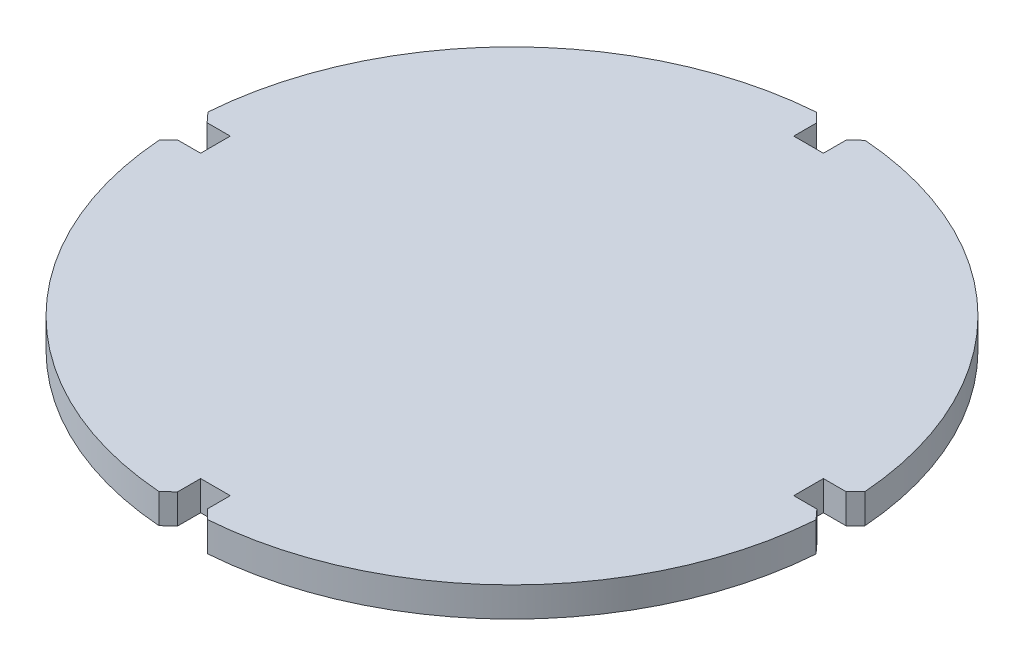
ISO-10303-21;
HEADER;
FILE_DESCRIPTION(('STEP AP214'),'2;1');
FILE_NAME('part.step','',(''),(''),'','','');
FILE_SCHEMA(('AUTOMOTIVE_DESIGN { 1 0 10303 214 1 1 1 1 }'));
ENDSEC;
DATA;
#1=APPLICATION_CONTEXT('core data for automotive mechanical design processes');
#2=APPLICATION_PROTOCOL_DEFINITION('international standard','automotive_design',2000,#1);
#3=PRODUCT_CONTEXT('',#1,'mechanical');
#4=PRODUCT('Part','Part','',(#3));
#5=PRODUCT_RELATED_PRODUCT_CATEGORY('part','',(#4));
#6=PRODUCT_DEFINITION_FORMATION('','',#4);
#7=PRODUCT_DEFINITION_CONTEXT('part definition',#1,'design');
#8=PRODUCT_DEFINITION('design','',#6,#7);
#9=PRODUCT_DEFINITION_SHAPE('','',#8);
#10=(LENGTH_UNIT() NAMED_UNIT(*) SI_UNIT(.MILLI.,.METRE.));
#11=(NAMED_UNIT(*) PLANE_ANGLE_UNIT() SI_UNIT($,.RADIAN.));
#12=(NAMED_UNIT(*) SI_UNIT($,.STERADIAN.) SOLID_ANGLE_UNIT());
#13=UNCERTAINTY_MEASURE_WITH_UNIT(LENGTH_MEASURE(1.E-05),#10,'distance_accuracy_value','');
#14=(GEOMETRIC_REPRESENTATION_CONTEXT(3) GLOBAL_UNCERTAINTY_ASSIGNED_CONTEXT((#13)) GLOBAL_UNIT_ASSIGNED_CONTEXT((#10,
#11,#12)) REPRESENTATION_CONTEXT('',''));
#15=CARTESIAN_POINT('',(0.,0.,0.));
#16=DIRECTION('',(0.,0.,1.));
#17=DIRECTION('',(1.,0.,0.));
#18=AXIS2_PLACEMENT_3D('',#15,#16,#17);
#19=CARTESIAN_POINT('',(-2.25000000000001,4.5,-49.9493493451116));
#20=DIRECTION('',(1.,0.,0.));
#21=DIRECTION('',(0.,0.,-1.));
#22=AXIS2_PLACEMENT_3D('',#19,#20,#21);
#23=PLANE('',#22);
#24=DIRECTION('',(0.,0.,1.));
#25=VECTOR('',#24,1.);
#26=CARTESIAN_POINT('',(-2.25000000000001,0.,-49.9493493451116));
#27=LINE('',#26,#25);
#28=CARTESIAN_POINT('',(-2.25000000000001,0.,-48.4493493451116));
#29=VERTEX_POINT('',#28);
#30=CARTESIAN_POINT('',(-2.25000000000001,0.,-45.));
#31=VERTEX_POINT('',#30);
#32=EDGE_CURVE('E257',#29,#31,#27,.T.);
#33=ORIENTED_EDGE('',*,*,#32,.F.);
#34=DIRECTION('',(0.,1.,0.));
#35=VECTOR('',#34,1.);
#36=CARTESIAN_POINT('',(-2.25000000000001,4.5,-48.4493493451116));
#37=LINE('',#36,#35);
#38=CARTESIAN_POINT('',(-2.25000000000001,4.5,-48.4493493451116));
#39=VERTEX_POINT('',#38);
#40=EDGE_CURVE('E203',#29,#39,#37,.T.);
#41=ORIENTED_EDGE('',*,*,#40,.T.);
#42=DIRECTION('',(0.,0.,1.));
#43=VECTOR('',#42,1.);
#44=CARTESIAN_POINT('',(-2.25000000000001,4.5,-49.9493493451116));
#45=LINE('',#44,#43);
#46=CARTESIAN_POINT('',(-2.25000000000001,4.5,-45.));
#47=VERTEX_POINT('',#46);
#48=EDGE_CURVE('E197',#39,#47,#45,.T.);
#49=ORIENTED_EDGE('',*,*,#48,.T.);
#50=DIRECTION('',(0.,-1.,0.));
#51=VECTOR('',#50,1.);
#52=CARTESIAN_POINT('',(-2.25000000000001,4.5,-45.));
#53=LINE('',#52,#51);
#54=EDGE_CURVE('E200',#47,#31,#53,.T.);
#55=ORIENTED_EDGE('',*,*,#54,.T.);
#56=EDGE_LOOP('',(#33,#41,#49,#55));
#57=FACE_BOUND('',#56,.T.);
#58=ADVANCED_FACE('F33',(#57),#23,.T.);
#59=CARTESIAN_POINT('',(0.,4.5,0.));
#60=DIRECTION('',(0.,-1.,0.));
#61=DIRECTION('',(0.,0.,-1.));
#62=AXIS2_PLACEMENT_3D('',#59,#60,#61);
#63=CYLINDRICAL_SURFACE('',#62,50.);
#64=CARTESIAN_POINT('',(0.,0.,0.));
#65=DIRECTION('',(0.,1.,0.));
#66=DIRECTION('',(0.,0.,1.));
#67=AXIS2_PLACEMENT_3D('',#64,#65,#66);
#68=CIRCLE('',#67,50.);
#69=CARTESIAN_POINT('',(-3.6660689192461,0.,-49.8654182643577));
#70=VERTEX_POINT('',#69);
#71=CARTESIAN_POINT('',(-49.8610009765848,0.,-3.72566525777803));
#72=VERTEX_POINT('',#71);
#73=EDGE_CURVE('E207',#70,#72,#68,.T.);
#74=ORIENTED_EDGE('',*,*,#73,.T.);
#75=DIRECTION('',(0.,-1.,0.));
#76=VECTOR('',#75,1.);
#77=CARTESIAN_POINT('',(-49.8610009765848,4.5,-3.72566525777803));
#78=LINE('',#77,#76);
#79=CARTESIAN_POINT('',(-49.8610009765848,4.5,-3.72566525777803));
#80=VERTEX_POINT('',#79);
#81=EDGE_CURVE('E357',#72,#80,#78,.F.);
#82=ORIENTED_EDGE('',*,*,#81,.T.);
#83=CARTESIAN_POINT('',(0.,4.5,0.));
#84=DIRECTION('',(0.,1.,0.));
#85=DIRECTION('',(0.,0.,1.));
#86=AXIS2_PLACEMENT_3D('',#83,#84,#85);
#87=CIRCLE('',#86,50.);
#88=CARTESIAN_POINT('',(-3.6660689192461,4.5,-49.8654182643577));
#89=VERTEX_POINT('',#88);
#90=EDGE_CURVE('E215',#89,#80,#87,.T.);
#91=ORIENTED_EDGE('',*,*,#90,.F.);
#92=DIRECTION('',(0.,-1.,0.));
#93=VECTOR('',#92,1.);
#94=CARTESIAN_POINT('',(-3.6660689192461,4.5,-49.8654182643577));
#95=LINE('',#94,#93);
#96=EDGE_CURVE('E354',#89,#70,#95,.T.);
#97=ORIENTED_EDGE('',*,*,#96,.T.);
#98=EDGE_LOOP('',(#74,#82,#91,#97));
#99=FACE_BOUND('',#98,.T.);
#100=ADVANCED_FACE('F433',(#99),#63,.T.);
#101=CARTESIAN_POINT('',(-45.,4.5,-2.24999999999999));
#102=DIRECTION('',(0.,0.,1.));
#103=DIRECTION('',(1.,0.,0.));
#104=AXIS2_PLACEMENT_3D('',#101,#102,#103);
#105=PLANE('',#104);
#106=DIRECTION('',(-1.,0.,0.));
#107=VECTOR('',#106,1.);
#108=CARTESIAN_POINT('',(-45.,4.5,-2.24999999999999));
#109=LINE('',#108,#107);
#110=CARTESIAN_POINT('',(-45.,4.5,-2.24999999999999));
#111=VERTEX_POINT('',#110);
#112=CARTESIAN_POINT('',(-48.5125498267087,4.5,-2.25));
#113=VERTEX_POINT('',#112);
#114=EDGE_CURVE('E252',#111,#113,#109,.T.);
#115=ORIENTED_EDGE('',*,*,#114,.T.);
#116=DIRECTION('',(0.,-1.,0.));
#117=VECTOR('',#116,1.);
#118=CARTESIAN_POINT('',(-48.5125498267087,0.,-2.25));
#119=LINE('',#118,#117);
#120=CARTESIAN_POINT('',(-48.5125498267087,0.,-2.25));
#121=VERTEX_POINT('',#120);
#122=EDGE_CURVE('E351',#113,#121,#119,.T.);
#123=ORIENTED_EDGE('',*,*,#122,.T.);
#124=DIRECTION('',(-1.,0.,0.));
#125=VECTOR('',#124,1.);
#126=CARTESIAN_POINT('',(-45.,0.,-2.24999999999999));
#127=LINE('',#126,#125);
#128=CARTESIAN_POINT('',(-45.,0.,-2.24999999999999));
#129=VERTEX_POINT('',#128);
#130=EDGE_CURVE('E292',#129,#121,#127,.T.);
#131=ORIENTED_EDGE('',*,*,#130,.F.);
#132=DIRECTION('',(0.,-1.,0.));
#133=VECTOR('',#132,1.);
#134=CARTESIAN_POINT('',(-45.,4.5,-2.24999999999999));
#135=LINE('',#134,#133);
#136=EDGE_CURVE('E297',#111,#129,#135,.T.);
#137=ORIENTED_EDGE('',*,*,#136,.F.);
#138=EDGE_LOOP('',(#115,#123,#131,#137));
#139=FACE_BOUND('',#138,.T.);
#140=ADVANCED_FACE('F441',(#139),#105,.T.);
#141=CARTESIAN_POINT('',(-45.,4.5,2.25));
#142=DIRECTION('',(-1.,0.,0.));
#143=DIRECTION('',(0.,0.,1.));
#144=AXIS2_PLACEMENT_3D('',#141,#142,#143);
#145=PLANE('',#144);
#146=DIRECTION('',(0.,0.,-1.));
#147=VECTOR('',#146,1.);
#148=CARTESIAN_POINT('',(-45.,0.,2.25));
#149=LINE('',#148,#147);
#150=CARTESIAN_POINT('',(-45.,0.,2.25));
#151=VERTEX_POINT('',#150);
#152=EDGE_CURVE('E289',#151,#129,#149,.T.);
#153=ORIENTED_EDGE('',*,*,#152,.F.);
#154=DIRECTION('',(0.,-1.,0.));
#155=VECTOR('',#154,1.);
#156=CARTESIAN_POINT('',(-45.,4.5,2.25));
#157=LINE('',#156,#155);
#158=CARTESIAN_POINT('',(-45.,4.5,2.25));
#159=VERTEX_POINT('',#158);
#160=EDGE_CURVE('E300',#159,#151,#157,.T.);
#161=ORIENTED_EDGE('',*,*,#160,.F.);
#162=DIRECTION('',(0.,0.,-1.));
#163=VECTOR('',#162,1.);
#164=CARTESIAN_POINT('',(-45.,4.5,2.25));
#165=LINE('',#164,#163);
#166=EDGE_CURVE('E249',#159,#111,#165,.T.);
#167=ORIENTED_EDGE('',*,*,#166,.T.);
#168=ORIENTED_EDGE('',*,*,#136,.T.);
#169=EDGE_LOOP('',(#153,#161,#167,#168));
#170=FACE_BOUND('',#169,.T.);
#171=ADVANCED_FACE('F445',(#170),#145,.T.);
#172=CARTESIAN_POINT('',(-49.9493493451116,4.5,2.25000000000001));
#173=DIRECTION('',(0.,0.,-1.));
#174=DIRECTION('',(-1.,0.,0.));
#175=AXIS2_PLACEMENT_3D('',#172,#173,#174);
#176=PLANE('',#175);
#177=DIRECTION('',(1.,0.,0.));
#178=VECTOR('',#177,1.);
#179=CARTESIAN_POINT('',(-49.9493493451116,0.,2.25000000000001));
#180=LINE('',#179,#178);
#181=CARTESIAN_POINT('',(-48.4493493451116,0.,2.25000000000001));
#182=VERTEX_POINT('',#181);
#183=EDGE_CURVE('E287',#182,#151,#180,.T.);
#184=ORIENTED_EDGE('',*,*,#183,.F.);
#185=DIRECTION('',(0.,1.,0.));
#186=VECTOR('',#185,1.);
#187=CARTESIAN_POINT('',(-48.4493493451116,4.5,2.25000000000001));
#188=LINE('',#187,#186);
#189=CARTESIAN_POINT('',(-48.4493493451116,4.5,2.25000000000001));
#190=VERTEX_POINT('',#189);
#191=EDGE_CURVE('E334',#182,#190,#188,.T.);
#192=ORIENTED_EDGE('',*,*,#191,.T.);
#193=DIRECTION('',(1.,0.,0.));
#194=VECTOR('',#193,1.);
#195=CARTESIAN_POINT('',(-49.9493493451116,4.5,2.25000000000001));
#196=LINE('',#195,#194);
#197=EDGE_CURVE('E247',#190,#159,#196,.T.);
#198=ORIENTED_EDGE('',*,*,#197,.T.);
#199=ORIENTED_EDGE('',*,*,#160,.T.);
#200=EDGE_LOOP('',(#184,#192,#198,#199));
#201=FACE_BOUND('',#200,.T.);
#202=ADVANCED_FACE('F622',(#201),#176,.T.);
#203=CARTESIAN_POINT('',(0.,4.5,0.));
#204=DIRECTION('',(0.,-1.,0.));
#205=DIRECTION('',(0.,0.,-1.));
#206=AXIS2_PLACEMENT_3D('',#203,#204,#205);
#207=CYLINDRICAL_SURFACE('',#206,50.);
#208=CARTESIAN_POINT('',(0.,4.5,0.));
#209=DIRECTION('',(0.,1.,0.));
#210=DIRECTION('',(0.,0.,1.));
#211=AXIS2_PLACEMENT_3D('',#208,#209,#210);
#212=CIRCLE('',#211,50.);
#213=CARTESIAN_POINT('',(-49.8654182643577,4.5,3.66606891924611));
#214=VERTEX_POINT('',#213);
#215=CARTESIAN_POINT('',(-3.72566525777803,4.5,49.8610009765848));
#216=VERTEX_POINT('',#215);
#217=EDGE_CURVE('E244',#214,#216,#212,.T.);
#218=ORIENTED_EDGE('',*,*,#217,.F.);
#219=DIRECTION('',(0.,-1.,0.));
#220=VECTOR('',#219,1.);
#221=CARTESIAN_POINT('',(-49.8654182643577,4.5,3.66606891924611));
#222=LINE('',#221,#220);
#223=CARTESIAN_POINT('',(-49.8654182643577,0.,3.66606891924611));
#224=VERTEX_POINT('',#223);
#225=EDGE_CURVE('E315',#214,#224,#222,.T.);
#226=ORIENTED_EDGE('',*,*,#225,.T.);
#227=CARTESIAN_POINT('',(0.,0.,0.));
#228=DIRECTION('',(0.,1.,0.));
#229=DIRECTION('',(0.,0.,1.));
#230=AXIS2_PLACEMENT_3D('',#227,#228,#229);
#231=CIRCLE('',#230,50.);
#232=CARTESIAN_POINT('',(-3.72566525777803,0.,49.8610009765848));
#233=VERTEX_POINT('',#232);
#234=EDGE_CURVE('E284',#224,#233,#231,.T.);
#235=ORIENTED_EDGE('',*,*,#234,.T.);
#236=DIRECTION('',(0.,-1.,0.));
#237=VECTOR('',#236,1.);
#238=CARTESIAN_POINT('',(-3.72566525777803,4.5,49.8610009765848));
#239=LINE('',#238,#237);
#240=EDGE_CURVE('E299',#233,#216,#239,.F.);
#241=ORIENTED_EDGE('',*,*,#240,.T.);
#242=EDGE_LOOP('',(#218,#226,#235,#241));
#243=FACE_BOUND('',#242,.T.);
#244=ADVANCED_FACE('F455',(#243),#207,.T.);
#245=CARTESIAN_POINT('',(-2.25,4.5,45.));
#246=DIRECTION('',(1.,0.,0.));
#247=DIRECTION('',(0.,0.,-1.));
#248=AXIS2_PLACEMENT_3D('',#245,#246,#247);
#249=PLANE('',#248);
#250=DIRECTION('',(0.,0.,1.));
#251=VECTOR('',#250,1.);
#252=CARTESIAN_POINT('',(-2.25,4.5,45.));
#253=LINE('',#252,#251);
#254=CARTESIAN_POINT('',(-2.25,4.5,45.));
#255=VERTEX_POINT('',#254);
#256=CARTESIAN_POINT('',(-2.25,4.5,48.5125498267087));
#257=VERTEX_POINT('',#256);
#258=EDGE_CURVE('E241',#255,#257,#253,.T.);
#259=ORIENTED_EDGE('',*,*,#258,.T.);
#260=DIRECTION('',(0.,-1.,0.));
#261=VECTOR('',#260,1.);
#262=CARTESIAN_POINT('',(-2.25,0.,48.5125498267087));
#263=LINE('',#262,#261);
#264=CARTESIAN_POINT('',(-2.25,0.,48.5125498267087));
#265=VERTEX_POINT('',#264);
#266=EDGE_CURVE('E11',#257,#265,#263,.T.);
#267=ORIENTED_EDGE('',*,*,#266,.T.);
#268=DIRECTION('',(0.,0.,1.));
#269=VECTOR('',#268,1.);
#270=CARTESIAN_POINT('',(-2.25,0.,45.));
#271=LINE('',#270,#269);
#272=CARTESIAN_POINT('',(-2.25,0.,45.));
#273=VERTEX_POINT('',#272);
#274=EDGE_CURVE('E281',#273,#265,#271,.T.);
#275=ORIENTED_EDGE('',*,*,#274,.F.);
#276=DIRECTION('',(0.,-1.,0.));
#277=VECTOR('',#276,1.);
#278=CARTESIAN_POINT('',(-2.25,4.5,45.));
#279=LINE('',#278,#277);
#280=EDGE_CURVE('E303',#255,#273,#279,.T.);
#281=ORIENTED_EDGE('',*,*,#280,.F.);
#282=EDGE_LOOP('',(#259,#267,#275,#281));
#283=FACE_BOUND('',#282,.T.);
#284=ADVANCED_FACE('F463',(#283),#249,.T.);
#285=CARTESIAN_POINT('',(2.25,4.5,45.));
#286=DIRECTION('',(0.,0.,1.));
#287=DIRECTION('',(1.,0.,0.));
#288=AXIS2_PLACEMENT_3D('',#285,#286,#287);
#289=PLANE('',#288);
#290=DIRECTION('',(-1.,0.,0.));
#291=VECTOR('',#290,1.);
#292=CARTESIAN_POINT('',(2.25,0.,45.));
#293=LINE('',#292,#291);
#294=CARTESIAN_POINT('',(2.25,0.,45.));
#295=VERTEX_POINT('',#294);
#296=EDGE_CURVE('E278',#295,#273,#293,.T.);
#297=ORIENTED_EDGE('',*,*,#296,.F.);
#298=DIRECTION('',(0.,-1.,0.));
#299=VECTOR('',#298,1.);
#300=CARTESIAN_POINT('',(2.25,4.5,45.));
#301=LINE('',#300,#299);
#302=CARTESIAN_POINT('',(2.25,4.5,45.));
#303=VERTEX_POINT('',#302);
#304=EDGE_CURVE('E305',#303,#295,#301,.T.);
#305=ORIENTED_EDGE('',*,*,#304,.F.);
#306=DIRECTION('',(-1.,0.,0.));
#307=VECTOR('',#306,1.);
#308=CARTESIAN_POINT('',(2.25,4.5,45.));
#309=LINE('',#308,#307);
#310=EDGE_CURVE('E238',#303,#255,#309,.T.);
#311=ORIENTED_EDGE('',*,*,#310,.T.);
#312=ORIENTED_EDGE('',*,*,#280,.T.);
#313=EDGE_LOOP('',(#297,#305,#311,#312));
#314=FACE_BOUND('',#313,.T.);
#315=ADVANCED_FACE('F466',(#314),#289,.T.);
#316=CARTESIAN_POINT('',(2.25,4.5,49.9493493451116));
#317=DIRECTION('',(-1.,0.,0.));
#318=DIRECTION('',(0.,0.,1.));
#319=AXIS2_PLACEMENT_3D('',#316,#317,#318);
#320=PLANE('',#319);
#321=DIRECTION('',(0.,0.,-1.));
#322=VECTOR('',#321,1.);
#323=CARTESIAN_POINT('',(2.25,0.,49.9493493451116));
#324=LINE('',#323,#322);
#325=CARTESIAN_POINT('',(2.25,0.,48.4493493451116));
#326=VERTEX_POINT('',#325);
#327=EDGE_CURVE('E276',#326,#295,#324,.T.);
#328=ORIENTED_EDGE('',*,*,#327,.F.);
#329=DIRECTION('',(0.,1.,0.));
#330=VECTOR('',#329,1.);
#331=CARTESIAN_POINT('',(2.25,4.5,48.4493493451116));
#332=LINE('',#331,#330);
#333=CARTESIAN_POINT('',(2.25,4.5,48.4493493451116));
#334=VERTEX_POINT('',#333);
#335=EDGE_CURVE('E41',#326,#334,#332,.T.);
#336=ORIENTED_EDGE('',*,*,#335,.T.);
#337=DIRECTION('',(0.,0.,-1.));
#338=VECTOR('',#337,1.);
#339=CARTESIAN_POINT('',(2.25,4.5,49.9493493451116));
#340=LINE('',#339,#338);
#341=EDGE_CURVE('E236',#334,#303,#340,.T.);
#342=ORIENTED_EDGE('',*,*,#341,.T.);
#343=ORIENTED_EDGE('',*,*,#304,.T.);
#344=EDGE_LOOP('',(#328,#336,#342,#343));
#345=FACE_BOUND('',#344,.T.);
#346=ADVANCED_FACE('F380',(#345),#320,.T.);
#347=CARTESIAN_POINT('',(0.,4.5,0.));
#348=DIRECTION('',(0.,-1.,0.));
#349=DIRECTION('',(0.,0.,-1.));
#350=AXIS2_PLACEMENT_3D('',#347,#348,#349);
#351=CYLINDRICAL_SURFACE('',#350,50.);
#352=CARTESIAN_POINT('',(0.,0.,0.));
#353=DIRECTION('',(0.,1.,0.));
#354=DIRECTION('',(0.,0.,1.));
#355=AXIS2_PLACEMENT_3D('',#352,#353,#354);
#356=CIRCLE('',#355,50.);
#357=CARTESIAN_POINT('',(3.66606891924611,0.,49.8654182643577));
#358=VERTEX_POINT('',#357);
#359=CARTESIAN_POINT('',(49.8610009765848,0.,3.72566525777799));
#360=VERTEX_POINT('',#359);
#361=EDGE_CURVE('E273',#358,#360,#356,.T.);
#362=ORIENTED_EDGE('',*,*,#361,.T.);
#363=DIRECTION('',(0.,-1.,0.));
#364=VECTOR('',#363,1.);
#365=CARTESIAN_POINT('',(49.8610009765848,4.5,3.72566525777799));
#366=LINE('',#365,#364);
#367=CARTESIAN_POINT('',(49.8610009765848,4.5,3.72566525777799));
#368=VERTEX_POINT('',#367);
#369=EDGE_CURVE('E373',#360,#368,#366,.F.);
#370=ORIENTED_EDGE('',*,*,#369,.T.);
#371=CARTESIAN_POINT('',(0.,4.5,0.));
#372=DIRECTION('',(0.,1.,0.));
#373=DIRECTION('',(0.,0.,1.));
#374=AXIS2_PLACEMENT_3D('',#371,#372,#373);
#375=CIRCLE('',#374,50.);
#376=CARTESIAN_POINT('',(3.66606891924611,4.5,49.8654182643577));
#377=VERTEX_POINT('',#376);
#378=EDGE_CURVE('E233',#377,#368,#375,.T.);
#379=ORIENTED_EDGE('',*,*,#378,.F.);
#380=DIRECTION('',(0.,-1.,0.));
#381=VECTOR('',#380,1.);
#382=CARTESIAN_POINT('',(3.66606891924611,4.5,49.8654182643577));
#383=LINE('',#382,#381);
#384=EDGE_CURVE('E370',#377,#358,#383,.T.);
#385=ORIENTED_EDGE('',*,*,#384,.T.);
#386=EDGE_LOOP('',(#362,#370,#379,#385));
#387=FACE_BOUND('',#386,.T.);
#388=ADVANCED_FACE('F391',(#387),#351,.T.);
#389=CARTESIAN_POINT('',(45.,4.5,2.25));
#390=DIRECTION('',(0.,0.,-1.));
#391=DIRECTION('',(-1.,0.,0.));
#392=AXIS2_PLACEMENT_3D('',#389,#390,#391);
#393=PLANE('',#392);
#394=DIRECTION('',(1.,0.,0.));
#395=VECTOR('',#394,1.);
#396=CARTESIAN_POINT('',(45.,4.5,2.25));
#397=LINE('',#396,#395);
#398=CARTESIAN_POINT('',(45.,4.5,2.25));
#399=VERTEX_POINT('',#398);
#400=CARTESIAN_POINT('',(48.5125498267087,4.5,2.25));
#401=VERTEX_POINT('',#400);
#402=EDGE_CURVE('E230',#399,#401,#397,.T.);
#403=ORIENTED_EDGE('',*,*,#402,.T.);
#404=DIRECTION('',(0.,-1.,0.));
#405=VECTOR('',#404,1.);
#406=CARTESIAN_POINT('',(48.5125498267087,0.,2.25));
#407=LINE('',#406,#405);
#408=CARTESIAN_POINT('',(48.5125498267087,0.,2.25));
#409=VERTEX_POINT('',#408);
#410=EDGE_CURVE('E367',#401,#409,#407,.T.);
#411=ORIENTED_EDGE('',*,*,#410,.T.);
#412=DIRECTION('',(1.,0.,0.));
#413=VECTOR('',#412,1.);
#414=CARTESIAN_POINT('',(45.,0.,2.25));
#415=LINE('',#414,#413);
#416=CARTESIAN_POINT('',(45.,0.,2.25));
#417=VERTEX_POINT('',#416);
#418=EDGE_CURVE('E270',#417,#409,#415,.T.);
#419=ORIENTED_EDGE('',*,*,#418,.F.);
#420=DIRECTION('',(0.,-1.,0.));
#421=VECTOR('',#420,1.);
#422=CARTESIAN_POINT('',(45.,4.5,2.25));
#423=LINE('',#422,#421);
#424=EDGE_CURVE('E308',#399,#417,#423,.T.);
#425=ORIENTED_EDGE('',*,*,#424,.F.);
#426=EDGE_LOOP('',(#403,#411,#419,#425));
#427=FACE_BOUND('',#426,.T.);
#428=ADVANCED_FACE('F402',(#427),#393,.T.);
#429=CARTESIAN_POINT('',(45.,4.5,-2.25));
#430=DIRECTION('',(1.,0.,0.));
#431=DIRECTION('',(0.,0.,-1.));
#432=AXIS2_PLACEMENT_3D('',#429,#430,#431);
#433=PLANE('',#432);
#434=DIRECTION('',(0.,0.,1.));
#435=VECTOR('',#434,1.);
#436=CARTESIAN_POINT('',(45.,0.,-2.25));
#437=LINE('',#436,#435);
#438=CARTESIAN_POINT('',(45.,0.,-2.25));
#439=VERTEX_POINT('',#438);
#440=EDGE_CURVE('E267',#439,#417,#437,.T.);
#441=ORIENTED_EDGE('',*,*,#440,.F.);
#442=DIRECTION('',(0.,-1.,0.));
#443=VECTOR('',#442,1.);
#444=CARTESIAN_POINT('',(45.,4.5,-2.25));
#445=LINE('',#444,#443);
#446=CARTESIAN_POINT('',(45.,4.5,-2.25));
#447=VERTEX_POINT('',#446);
#448=EDGE_CURVE('E310',#447,#439,#445,.T.);
#449=ORIENTED_EDGE('',*,*,#448,.F.);
#450=DIRECTION('',(0.,0.,1.));
#451=VECTOR('',#450,1.);
#452=CARTESIAN_POINT('',(45.,4.5,-2.25));
#453=LINE('',#452,#451);
#454=EDGE_CURVE('E227',#447,#399,#453,.T.);
#455=ORIENTED_EDGE('',*,*,#454,.T.);
#456=ORIENTED_EDGE('',*,*,#424,.T.);
#457=EDGE_LOOP('',(#441,#449,#455,#456));
#458=FACE_BOUND('',#457,.T.);
#459=ADVANCED_FACE('F409',(#458),#433,.T.);
#460=CARTESIAN_POINT('',(49.9493493451116,4.5,-2.25));
#461=DIRECTION('',(0.,0.,1.));
#462=DIRECTION('',(1.,0.,0.));
#463=AXIS2_PLACEMENT_3D('',#460,#461,#462);
#464=PLANE('',#463);
#465=DIRECTION('',(-1.,0.,0.));
#466=VECTOR('',#465,1.);
#467=CARTESIAN_POINT('',(49.9493493451116,0.,-2.25));
#468=LINE('',#467,#466);
#469=CARTESIAN_POINT('',(48.4493493451116,0.,-2.25));
#470=VERTEX_POINT('',#469);
#471=EDGE_CURVE('E265',#470,#439,#468,.T.);
#472=ORIENTED_EDGE('',*,*,#471,.F.);
#473=DIRECTION('',(0.,1.,0.));
#474=VECTOR('',#473,1.);
#475=CARTESIAN_POINT('',(48.4493493451116,4.5,-2.25));
#476=LINE('',#475,#474);
#477=CARTESIAN_POINT('',(48.4493493451116,4.5,-2.25));
#478=VERTEX_POINT('',#477);
#479=EDGE_CURVE('E375',#470,#478,#476,.T.);
#480=ORIENTED_EDGE('',*,*,#479,.T.);
#481=DIRECTION('',(-1.,0.,0.));
#482=VECTOR('',#481,1.);
#483=CARTESIAN_POINT('',(49.9493493451116,4.5,-2.25));
#484=LINE('',#483,#482);
#485=EDGE_CURVE('E225',#478,#447,#484,.T.);
#486=ORIENTED_EDGE('',*,*,#485,.T.);
#487=ORIENTED_EDGE('',*,*,#448,.T.);
#488=EDGE_LOOP('',(#472,#480,#486,#487));
#489=FACE_BOUND('',#488,.T.);
#490=ADVANCED_FACE('F412',(#489),#464,.T.);
#491=CARTESIAN_POINT('',(0.,4.5,0.));
#492=DIRECTION('',(0.,-1.,0.));
#493=DIRECTION('',(0.,0.,-1.));
#494=AXIS2_PLACEMENT_3D('',#491,#492,#493);
#495=CYLINDRICAL_SURFACE('',#494,50.);
#496=CARTESIAN_POINT('',(0.,0.,0.));
#497=DIRECTION('',(0.,1.,0.));
#498=DIRECTION('',(0.,0.,1.));
#499=AXIS2_PLACEMENT_3D('',#496,#497,#498);
#500=CIRCLE('',#499,50.);
#501=CARTESIAN_POINT('',(49.8654182643577,0.,-3.66606891924611));
#502=VERTEX_POINT('',#501);
#503=CARTESIAN_POINT('',(3.72566525777799,0.,-49.8610009765848));
#504=VERTEX_POINT('',#503);
#505=EDGE_CURVE('E263',#502,#504,#500,.T.);
#506=ORIENTED_EDGE('',*,*,#505,.T.);
#507=DIRECTION('',(0.,-1.,0.));
#508=VECTOR('',#507,1.);
#509=CARTESIAN_POINT('',(3.72566525777799,4.5,-49.8610009765848));
#510=LINE('',#509,#508);
#511=CARTESIAN_POINT('',(3.72566525777799,4.5,-49.8610009765848));
#512=VERTEX_POINT('',#511);
#513=EDGE_CURVE('E56',#504,#512,#510,.F.);
#514=ORIENTED_EDGE('',*,*,#513,.T.);
#515=CARTESIAN_POINT('',(0.,4.5,0.));
#516=DIRECTION('',(0.,1.,0.));
#517=DIRECTION('',(0.,0.,1.));
#518=AXIS2_PLACEMENT_3D('',#515,#516,#517);
#519=CIRCLE('',#518,50.);
#520=CARTESIAN_POINT('',(49.8654182643577,4.5,-3.66606891924611));
#521=VERTEX_POINT('',#520);
#522=EDGE_CURVE('E221',#521,#512,#519,.T.);
#523=ORIENTED_EDGE('',*,*,#522,.F.);
#524=DIRECTION('',(0.,-1.,0.));
#525=VECTOR('',#524,1.);
#526=CARTESIAN_POINT('',(49.8654182643577,4.5,-3.66606891924611));
#527=LINE('',#526,#525);
#528=EDGE_CURVE('E362',#521,#502,#527,.T.);
#529=ORIENTED_EDGE('',*,*,#528,.T.);
#530=EDGE_LOOP('',(#506,#514,#523,#529));
#531=FACE_BOUND('',#530,.T.);
#532=ADVANCED_FACE('F419',(#531),#495,.T.);
#533=CARTESIAN_POINT('',(2.24999999999999,4.5,-45.));
#534=DIRECTION('',(-1.,0.,0.));
#535=DIRECTION('',(0.,0.,1.));
#536=AXIS2_PLACEMENT_3D('',#533,#534,#535);
#537=PLANE('',#536);
#538=DIRECTION('',(0.,0.,-1.));
#539=VECTOR('',#538,1.);
#540=CARTESIAN_POINT('',(2.24999999999999,4.5,-45.));
#541=LINE('',#540,#539);
#542=CARTESIAN_POINT('',(2.24999999999999,4.5,-45.));
#543=VERTEX_POINT('',#542);
#544=CARTESIAN_POINT('',(2.24999999999999,4.5,-48.5125498267087));
#545=VERTEX_POINT('',#544);
#546=EDGE_CURVE('E219',#543,#545,#541,.T.);
#547=ORIENTED_EDGE('',*,*,#546,.T.);
#548=DIRECTION('',(0.,-1.,0.));
#549=VECTOR('',#548,1.);
#550=CARTESIAN_POINT('',(2.24999999999999,0.,-48.5125498267087));
#551=LINE('',#550,#549);
#552=CARTESIAN_POINT('',(2.24999999999999,0.,-48.5125498267087));
#553=VERTEX_POINT('',#552);
#554=EDGE_CURVE('E359',#545,#553,#551,.T.);
#555=ORIENTED_EDGE('',*,*,#554,.T.);
#556=DIRECTION('',(0.,0.,-1.));
#557=VECTOR('',#556,1.);
#558=CARTESIAN_POINT('',(2.24999999999999,0.,-45.));
#559=LINE('',#558,#557);
#560=CARTESIAN_POINT('',(2.24999999999999,0.,-45.));
#561=VERTEX_POINT('',#560);
#562=EDGE_CURVE('E260',#561,#553,#559,.T.);
#563=ORIENTED_EDGE('',*,*,#562,.F.);
#564=DIRECTION('',(0.,-1.,0.));
#565=VECTOR('',#564,1.);
#566=CARTESIAN_POINT('',(2.24999999999999,4.5,-45.));
#567=LINE('',#566,#565);
#568=EDGE_CURVE('E214',#543,#561,#567,.T.);
#569=ORIENTED_EDGE('',*,*,#568,.F.);
#570=EDGE_LOOP('',(#547,#555,#563,#569));
#571=FACE_BOUND('',#570,.T.);
#572=ADVANCED_FACE('F425',(#571),#537,.T.);
#573=CARTESIAN_POINT('',(-2.25000000000001,4.5,-45.));
#574=DIRECTION('',(0.,0.,-1.));
#575=DIRECTION('',(-1.,0.,0.));
#576=AXIS2_PLACEMENT_3D('',#573,#574,#575);
#577=PLANE('',#576);
#578=DIRECTION('',(1.,0.,0.));
#579=VECTOR('',#578,1.);
#580=CARTESIAN_POINT('',(-2.25000000000001,0.,-45.));
#581=LINE('',#580,#579);
#582=EDGE_CURVE('E213',#31,#561,#581,.T.);
#583=ORIENTED_EDGE('',*,*,#582,.F.);
#584=ORIENTED_EDGE('',*,*,#54,.F.);
#585=DIRECTION('',(1.,0.,0.));
#586=VECTOR('',#585,1.);
#587=CARTESIAN_POINT('',(-2.25000000000001,4.5,-45.));
#588=LINE('',#587,#586);
#589=EDGE_CURVE('E206',#47,#543,#588,.T.);
#590=ORIENTED_EDGE('',*,*,#589,.T.);
#591=ORIENTED_EDGE('',*,*,#568,.T.);
#592=EDGE_LOOP('',(#583,#584,#590,#591));
#593=FACE_BOUND('',#592,.T.);
#594=ADVANCED_FACE('F211',(#593),#577,.T.);
#595=CARTESIAN_POINT('',(0.,4.5,0.));
#596=DIRECTION('',(0.,1.,0.));
#597=DIRECTION('',(0.,0.,1.));
#598=AXIS2_PLACEMENT_3D('',#595,#596,#597);
#599=PLANE('',#598);
#600=ORIENTED_EDGE('',*,*,#197,.F.);
#601=DIRECTION('',(0.707106781186546,0.,-0.707106781186549));
#602=VECTOR('',#601,1.);
#603=CARTESIAN_POINT('',(-23.0996746725559,4.5,-23.0996746725558));
#604=LINE('',#603,#602);
#605=EDGE_CURVE('E349',#190,#214,#604,.F.);
#606=ORIENTED_EDGE('',*,*,#605,.T.);
#607=ORIENTED_EDGE('',*,*,#217,.T.);
#608=DIRECTION('',(-0.738210277909083,0.,0.674570667602287));
#609=VECTOR('',#608,1.);
#610=CARTESIAN_POINT('',(23.1341844323791,4.5,25.3166844323793));
#611=LINE('',#610,#609);
#612=EDGE_CURVE('E336',#216,#257,#611,.F.);
#613=ORIENTED_EDGE('',*,*,#612,.T.);
#614=ORIENTED_EDGE('',*,*,#258,.F.);
#615=ORIENTED_EDGE('',*,*,#310,.F.);
#616=ORIENTED_EDGE('',*,*,#341,.F.);
#617=DIRECTION('',(-0.707106781186547,0.,-0.707106781186548));
#618=VECTOR('',#617,1.);
#619=CARTESIAN_POINT('',(-23.0996746725558,4.5,23.0996746725558));
#620=LINE('',#619,#618);
#621=EDGE_CURVE('E338',#334,#377,#620,.F.);
#622=ORIENTED_EDGE('',*,*,#621,.T.);
#623=ORIENTED_EDGE('',*,*,#378,.T.);
#624=DIRECTION('',(0.674570667602291,0.,0.738210277909079));
#625=VECTOR('',#624,1.);
#626=CARTESIAN_POINT('',(25.3166844323791,4.5,-23.1341844323791));
#627=LINE('',#626,#625);
#628=EDGE_CURVE('E342',#368,#401,#627,.F.);
#629=ORIENTED_EDGE('',*,*,#628,.T.);
#630=ORIENTED_EDGE('',*,*,#402,.F.);
#631=ORIENTED_EDGE('',*,*,#454,.F.);
#632=ORIENTED_EDGE('',*,*,#485,.F.);
#633=DIRECTION('',(-0.707106781186549,0.,0.707106781186546));
#634=VECTOR('',#633,1.);
#635=CARTESIAN_POINT('',(23.0996746725557,4.5,23.0996746725558));
#636=LINE('',#635,#634);
#637=EDGE_CURVE('E340',#478,#521,#636,.F.);
#638=ORIENTED_EDGE('',*,*,#637,.T.);
#639=ORIENTED_EDGE('',*,*,#522,.T.);
#640=DIRECTION('',(0.738210277909078,0.,-0.674570667602292));
#641=VECTOR('',#640,1.);
#642=CARTESIAN_POINT('',(-23.1341844323791,4.5,-25.316684432379));
#643=LINE('',#642,#641);
#644=EDGE_CURVE('E48',#512,#545,#643,.F.);
#645=ORIENTED_EDGE('',*,*,#644,.T.);
#646=ORIENTED_EDGE('',*,*,#546,.F.);
#647=ORIENTED_EDGE('',*,*,#589,.F.);
#648=ORIENTED_EDGE('',*,*,#48,.F.);
#649=DIRECTION('',(0.707106781186548,0.,0.707106781186547));
#650=VECTOR('',#649,1.);
#651=CARTESIAN_POINT('',(23.0996746725558,4.5,-23.0996746725558));
#652=LINE('',#651,#650);
#653=EDGE_CURVE('E344',#39,#89,#652,.F.);
#654=ORIENTED_EDGE('',*,*,#653,.T.);
#655=ORIENTED_EDGE('',*,*,#90,.T.);
#656=DIRECTION('',(-0.674570667602286,0.,-0.738210277909084));
#657=VECTOR('',#656,1.);
#658=CARTESIAN_POINT('',(-25.3166844323794,4.5,23.1341844323791));
#659=LINE('',#658,#657);
#660=EDGE_CURVE('E347',#80,#113,#659,.F.);
#661=ORIENTED_EDGE('',*,*,#660,.T.);
#662=ORIENTED_EDGE('',*,*,#114,.F.);
#663=ORIENTED_EDGE('',*,*,#166,.F.);
#664=EDGE_LOOP('',(#600,#606,#607,#613,#614,#615,#616,#622,#623,#629,#630,#631,#632,#638,#639,
#645,#646,#647,#648,#654,#655,#661,#662,#663));
#665=FACE_BOUND('',#664,.T.);
#666=ADVANCED_FACE('F218',(#665),#599,.T.);
#667=CARTESIAN_POINT('',(0.,0.,0.));
#668=DIRECTION('',(0.,1.,0.));
#669=DIRECTION('',(0.,0.,1.));
#670=AXIS2_PLACEMENT_3D('',#667,#668,#669);
#671=PLANE('',#670);
#672=ORIENTED_EDGE('',*,*,#234,.F.);
#673=DIRECTION('',(-0.707106781186546,0.,0.707106781186549));
#674=VECTOR('',#673,1.);
#675=CARTESIAN_POINT('',(-49.8654182643577,0.,3.66606891924612));
#676=LINE('',#675,#674);
#677=EDGE_CURVE('E332',#224,#182,#676,.F.);
#678=ORIENTED_EDGE('',*,*,#677,.T.);
#679=ORIENTED_EDGE('',*,*,#183,.T.);
#680=ORIENTED_EDGE('',*,*,#152,.T.);
#681=ORIENTED_EDGE('',*,*,#130,.T.);
#682=DIRECTION('',(0.674570667602286,0.,0.738210277909084));
#683=VECTOR('',#682,1.);
#684=CARTESIAN_POINT('',(-48.5125498267087,0.,-2.25));
#685=LINE('',#684,#683);
#686=EDGE_CURVE('E330',#121,#72,#685,.F.);
#687=ORIENTED_EDGE('',*,*,#686,.T.);
#688=ORIENTED_EDGE('',*,*,#73,.F.);
#689=DIRECTION('',(-0.707106781186548,0.,-0.707106781186547));
#690=VECTOR('',#689,1.);
#691=CARTESIAN_POINT('',(-3.66606891924611,0.,-49.8654182643577));
#692=LINE('',#691,#690);
#693=EDGE_CURVE('E326',#70,#29,#692,.F.);
#694=ORIENTED_EDGE('',*,*,#693,.T.);
#695=ORIENTED_EDGE('',*,*,#32,.T.);
#696=ORIENTED_EDGE('',*,*,#582,.T.);
#697=ORIENTED_EDGE('',*,*,#562,.T.);
#698=DIRECTION('',(-0.738210277909078,0.,0.674570667602292));
#699=VECTOR('',#698,1.);
#700=CARTESIAN_POINT('',(2.24999999999999,0.,-48.5125498267087));
#701=LINE('',#700,#699);
#702=EDGE_CURVE('E328',#553,#504,#701,.F.);
#703=ORIENTED_EDGE('',*,*,#702,.T.);
#704=ORIENTED_EDGE('',*,*,#505,.F.);
#705=DIRECTION('',(0.707106781186549,0.,-0.707106781186546));
#706=VECTOR('',#705,1.);
#707=CARTESIAN_POINT('',(49.8654182643577,0.,-3.66606891924612));
#708=LINE('',#707,#706);
#709=EDGE_CURVE('E322',#502,#470,#708,.F.);
#710=ORIENTED_EDGE('',*,*,#709,.T.);
#711=ORIENTED_EDGE('',*,*,#471,.T.);
#712=ORIENTED_EDGE('',*,*,#440,.T.);
#713=ORIENTED_EDGE('',*,*,#418,.T.);
#714=DIRECTION('',(-0.674570667602291,0.,-0.738210277909079));
#715=VECTOR('',#714,1.);
#716=CARTESIAN_POINT('',(48.5125498267087,0.,2.25));
#717=LINE('',#716,#715);
#718=EDGE_CURVE('E324',#409,#360,#717,.F.);
#719=ORIENTED_EDGE('',*,*,#718,.T.);
#720=ORIENTED_EDGE('',*,*,#361,.F.);
#721=DIRECTION('',(0.707106781186547,0.,0.707106781186548));
#722=VECTOR('',#721,1.);
#723=CARTESIAN_POINT('',(3.66606891924611,0.,49.8654182643577));
#724=LINE('',#723,#722);
#725=EDGE_CURVE('E320',#358,#326,#724,.F.);
#726=ORIENTED_EDGE('',*,*,#725,.T.);
#727=ORIENTED_EDGE('',*,*,#327,.T.);
#728=ORIENTED_EDGE('',*,*,#296,.T.);
#729=ORIENTED_EDGE('',*,*,#274,.T.);
#730=DIRECTION('',(0.738210277909083,0.,-0.674570667602287));
#731=VECTOR('',#730,1.);
#732=CARTESIAN_POINT('',(-2.25,0.,48.5125498267087));
#733=LINE('',#732,#731);
#734=EDGE_CURVE('E318',#265,#233,#733,.F.);
#735=ORIENTED_EDGE('',*,*,#734,.T.);
#736=EDGE_LOOP('',(#672,#678,#679,#680,#681,#687,#688,#694,#695,#696,#697,#703,#704,#710,#711,
#712,#713,#719,#720,#726,#727,#728,#729,#735));
#737=FACE_BOUND('',#736,.T.);
#738=ADVANCED_FACE('F395',(#737),#671,.F.);
#739=CARTESIAN_POINT('',(-49.8654182643577,4.5,3.66606891924612));
#740=DIRECTION('',(0.707106781186549,0.,0.707106781186546));
#741=DIRECTION('',(0.,-1.,0.));
#742=AXIS2_PLACEMENT_3D('',#739,#740,#741);
#743=PLANE('',#742);
#744=ORIENTED_EDGE('',*,*,#605,.F.);
#745=ORIENTED_EDGE('',*,*,#191,.F.);
#746=ORIENTED_EDGE('',*,*,#677,.F.);
#747=ORIENTED_EDGE('',*,*,#225,.F.);
#748=EDGE_LOOP('',(#744,#745,#746,#747));
#749=FACE_BOUND('',#748,.T.);
#750=ADVANCED_FACE('F453',(#749),#743,.F.);
#751=CARTESIAN_POINT('',(-48.5125498267087,4.5,-2.25));
#752=DIRECTION('',(0.738210277909084,0.,-0.674570667602286));
#753=DIRECTION('',(0.,-1.,0.));
#754=AXIS2_PLACEMENT_3D('',#751,#752,#753);
#755=PLANE('',#754);
#756=ORIENTED_EDGE('',*,*,#660,.F.);
#757=ORIENTED_EDGE('',*,*,#81,.F.);
#758=ORIENTED_EDGE('',*,*,#686,.F.);
#759=ORIENTED_EDGE('',*,*,#122,.F.);
#760=EDGE_LOOP('',(#756,#757,#758,#759));
#761=FACE_BOUND('',#760,.T.);
#762=ADVANCED_FACE('F436',(#761),#755,.F.);
#763=CARTESIAN_POINT('',(2.24999999999999,4.5,-48.5125498267087));
#764=DIRECTION('',(0.674570667602292,0.,0.738210277909078));
#765=DIRECTION('',(0.,-1.,0.));
#766=AXIS2_PLACEMENT_3D('',#763,#764,#765);
#767=PLANE('',#766);
#768=ORIENTED_EDGE('',*,*,#644,.F.);
#769=ORIENTED_EDGE('',*,*,#513,.F.);
#770=ORIENTED_EDGE('',*,*,#702,.F.);
#771=ORIENTED_EDGE('',*,*,#554,.F.);
#772=EDGE_LOOP('',(#768,#769,#770,#771));
#773=FACE_BOUND('',#772,.T.);
#774=ADVANCED_FACE('F423',(#773),#767,.F.);
#775=CARTESIAN_POINT('',(-3.66606891924611,4.5,-49.8654182643577));
#776=DIRECTION('',(-0.707106781186547,0.,0.707106781186548));
#777=DIRECTION('',(0.,-1.,0.));
#778=AXIS2_PLACEMENT_3D('',#775,#776,#777);
#779=PLANE('',#778);
#780=ORIENTED_EDGE('',*,*,#653,.F.);
#781=ORIENTED_EDGE('',*,*,#40,.F.);
#782=ORIENTED_EDGE('',*,*,#693,.F.);
#783=ORIENTED_EDGE('',*,*,#96,.F.);
#784=EDGE_LOOP('',(#780,#781,#782,#783));
#785=FACE_BOUND('',#784,.T.);
#786=ADVANCED_FACE('F428',(#785),#779,.F.);
#787=CARTESIAN_POINT('',(48.5125498267087,4.5,2.25));
#788=DIRECTION('',(-0.738210277909079,0.,0.674570667602291));
#789=DIRECTION('',(0.,-1.,0.));
#790=AXIS2_PLACEMENT_3D('',#787,#788,#789);
#791=PLANE('',#790);
#792=ORIENTED_EDGE('',*,*,#628,.F.);
#793=ORIENTED_EDGE('',*,*,#369,.F.);
#794=ORIENTED_EDGE('',*,*,#718,.F.);
#795=ORIENTED_EDGE('',*,*,#410,.F.);
#796=EDGE_LOOP('',(#792,#793,#794,#795));
#797=FACE_BOUND('',#796,.T.);
#798=ADVANCED_FACE('F400',(#797),#791,.F.);
#799=CARTESIAN_POINT('',(49.8654182643577,4.5,-3.66606891924612));
#800=DIRECTION('',(-0.707106781186546,0.,-0.707106781186549));
#801=DIRECTION('',(0.,-1.,0.));
#802=AXIS2_PLACEMENT_3D('',#799,#800,#801);
#803=PLANE('',#802);
#804=ORIENTED_EDGE('',*,*,#637,.F.);
#805=ORIENTED_EDGE('',*,*,#479,.F.);
#806=ORIENTED_EDGE('',*,*,#709,.F.);
#807=ORIENTED_EDGE('',*,*,#528,.F.);
#808=EDGE_LOOP('',(#804,#805,#806,#807));
#809=FACE_BOUND('',#808,.T.);
#810=ADVANCED_FACE('F417',(#809),#803,.F.);
#811=CARTESIAN_POINT('',(3.66606891924611,4.5,49.8654182643577));
#812=DIRECTION('',(0.707106781186548,0.,-0.707106781186547));
#813=DIRECTION('',(0.,-1.,0.));
#814=AXIS2_PLACEMENT_3D('',#811,#812,#813);
#815=PLANE('',#814);
#816=ORIENTED_EDGE('',*,*,#621,.F.);
#817=ORIENTED_EDGE('',*,*,#335,.F.);
#818=ORIENTED_EDGE('',*,*,#725,.F.);
#819=ORIENTED_EDGE('',*,*,#384,.F.);
#820=EDGE_LOOP('',(#816,#817,#818,#819));
#821=FACE_BOUND('',#820,.T.);
#822=ADVANCED_FACE('F388',(#821),#815,.F.);
#823=CARTESIAN_POINT('',(-2.25,4.5,48.5125498267087));
#824=DIRECTION('',(-0.674570667602287,0.,-0.738210277909083));
#825=DIRECTION('',(0.,-1.,0.));
#826=AXIS2_PLACEMENT_3D('',#823,#824,#825);
#827=PLANE('',#826);
#828=ORIENTED_EDGE('',*,*,#612,.F.);
#829=ORIENTED_EDGE('',*,*,#240,.F.);
#830=ORIENTED_EDGE('',*,*,#734,.F.);
#831=ORIENTED_EDGE('',*,*,#266,.F.);
#832=EDGE_LOOP('',(#828,#829,#830,#831));
#833=FACE_BOUND('',#832,.T.);
#834=ADVANCED_FACE('F35',(#833),#827,.F.);
#835=CLOSED_SHELL('',(#58,#100,#140,#171,#202,#244,#284,#315,#346,#388,#428,#459,#490,#532,#572,
#594,#666,#738,#750,#762,#774,#786,#798,#810,#822,#834));
#836=MANIFOLD_SOLID_BREP('B2',#835);
#837=ADVANCED_BREP_SHAPE_REPRESENTATION('',(#18,#836),#14);
#838=SHAPE_DEFINITION_REPRESENTATION(#9,#837);
ENDSEC;
END-ISO-10303-21;
